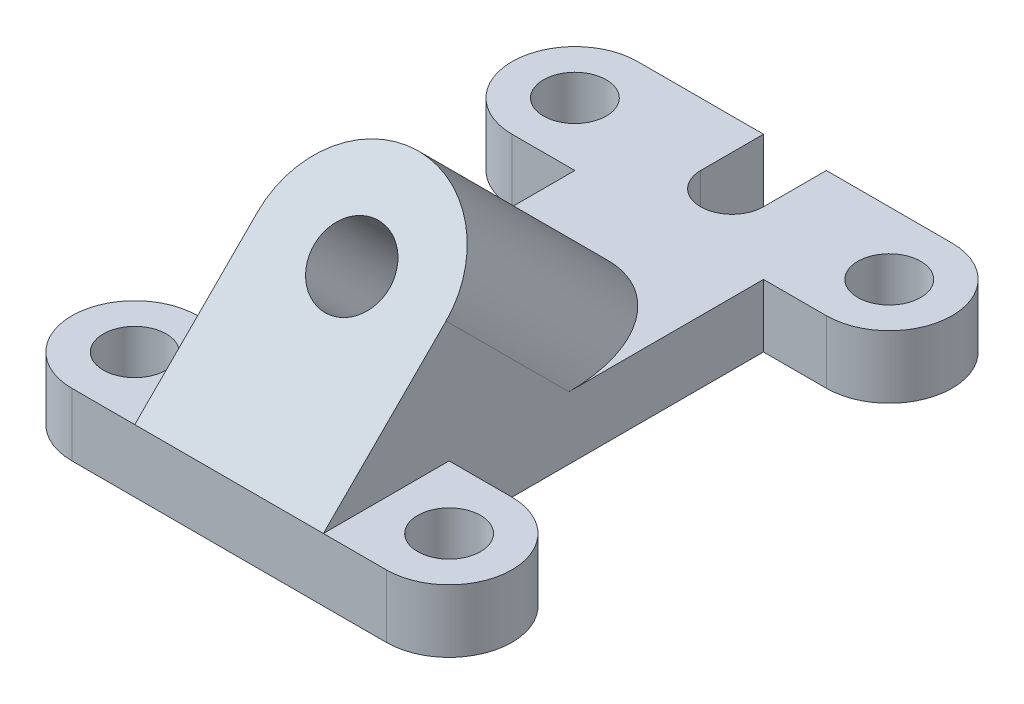
ISO-10303-21;
HEADER;
FILE_DESCRIPTION(('STEP AP214'),'2;1');
FILE_NAME('part.step','',(''),(''),'','','');
FILE_SCHEMA(('AUTOMOTIVE_DESIGN { 1 0 10303 214 1 1 1 1 }'));
ENDSEC;
DATA;
#1=APPLICATION_CONTEXT('core data for automotive mechanical design processes');
#2=APPLICATION_PROTOCOL_DEFINITION('international standard','automotive_design',2000,#1);
#3=PRODUCT_CONTEXT('',#1,'mechanical');
#4=PRODUCT('Part','Part','',(#3));
#5=PRODUCT_RELATED_PRODUCT_CATEGORY('part','',(#4));
#6=PRODUCT_DEFINITION_FORMATION('','',#4);
#7=PRODUCT_DEFINITION_CONTEXT('part definition',#1,'design');
#8=PRODUCT_DEFINITION('design','',#6,#7);
#9=PRODUCT_DEFINITION_SHAPE('','',#8);
#10=(LENGTH_UNIT() NAMED_UNIT(*) SI_UNIT(.MILLI.,.METRE.));
#11=(NAMED_UNIT(*) PLANE_ANGLE_UNIT() SI_UNIT($,.RADIAN.));
#12=(NAMED_UNIT(*) SI_UNIT($,.STERADIAN.) SOLID_ANGLE_UNIT());
#13=UNCERTAINTY_MEASURE_WITH_UNIT(LENGTH_MEASURE(1.E-05),#10,'distance_accuracy_value','');
#14=(GEOMETRIC_REPRESENTATION_CONTEXT(3) GLOBAL_UNCERTAINTY_ASSIGNED_CONTEXT((#13)) GLOBAL_UNIT_ASSIGNED_CONTEXT((#10,
#11,#12)) REPRESENTATION_CONTEXT('',''));
#15=CARTESIAN_POINT('',(0.,0.,0.));
#16=DIRECTION('',(0.,0.,1.));
#17=DIRECTION('',(1.,0.,0.));
#18=AXIS2_PLACEMENT_3D('',#15,#16,#17);
#19=CARTESIAN_POINT('',(-63.5,12.7,-88.9));
#20=DIRECTION('',(0.,1.,0.));
#21=DIRECTION('',(0.,0.,1.));
#22=AXIS2_PLACEMENT_3D('',#19,#20,#21);
#23=PLANE('',#22);
#24=CARTESIAN_POINT('',(0.,12.7,0.));
#25=DIRECTION('',(0.,1.,0.));
#26=DIRECTION('',(0.,0.,1.));
#27=AXIS2_PLACEMENT_3D('',#24,#25,#26);
#28=CIRCLE('',#27,6.35);
#29=CARTESIAN_POINT('',(0.,12.7,6.35));
#30=VERTEX_POINT('',#29);
#31=EDGE_CURVE('E213',#30,#30,#28,.T.);
#32=ORIENTED_EDGE('',*,*,#31,.F.);
#33=EDGE_LOOP('',(#32));
#34=FACE_BOUND('',#33,.T.);
#35=DIRECTION('',(-1.,0.,0.));
#36=VECTOR('',#35,1.);
#37=CARTESIAN_POINT('',(-12.7,12.7,-12.7));
#38=LINE('',#37,#36);
#39=CARTESIAN_POINT('',(0.,12.7,-12.7));
#40=VERTEX_POINT('',#39);
#41=CARTESIAN_POINT('',(-12.7,12.7,-12.7));
#42=VERTEX_POINT('',#41);
#43=EDGE_CURVE('E327',#40,#42,#38,.T.);
#44=ORIENTED_EDGE('',*,*,#43,.T.);
#45=DIRECTION('',(0.,0.,1.));
#46=VECTOR('',#45,1.);
#47=CARTESIAN_POINT('',(-12.7,12.7,-75.5869211077134));
#48=LINE('',#47,#46);
#49=CARTESIAN_POINT('',(-12.7,12.7,12.7));
#50=VERTEX_POINT('',#49);
#51=EDGE_CURVE('E12',#42,#50,#48,.T.);
#52=ORIENTED_EDGE('',*,*,#51,.T.);
#53=DIRECTION('',(1.,0.,0.));
#54=VECTOR('',#53,1.);
#55=CARTESIAN_POINT('',(-63.5,12.7,12.7));
#56=LINE('',#55,#54);
#57=CARTESIAN_POINT('',(0.,12.7,12.7));
#58=VERTEX_POINT('',#57);
#59=EDGE_CURVE('E321',#50,#58,#56,.T.);
#60=ORIENTED_EDGE('',*,*,#59,.T.);
#61=CARTESIAN_POINT('',(0.,12.7,0.));
#62=DIRECTION('',(0.,1.,0.));
#63=DIRECTION('',(0.,0.,1.));
#64=AXIS2_PLACEMENT_3D('',#61,#62,#63);
#65=CIRCLE('',#64,12.7);
#66=EDGE_CURVE('E325',#58,#40,#65,.T.);
#67=ORIENTED_EDGE('',*,*,#66,.T.);
#68=EDGE_LOOP('',(#44,#52,#60,#67));
#69=FACE_BOUND('',#68,.T.);
#70=ADVANCED_FACE('F54',(#34,#69),#23,.T.);
#71=CARTESIAN_POINT('',(-63.5,12.7,0.));
#72=DIRECTION('',(0.,1.,0.));
#73=DIRECTION('',(0.,0.,1.));
#74=AXIS2_PLACEMENT_3D('',#71,#72,#73);
#75=CIRCLE('',#74,6.35);
#76=CARTESIAN_POINT('',(-63.5,12.7,6.35));
#77=VERTEX_POINT('',#76);
#78=EDGE_CURVE('E297',#77,#77,#75,.T.);
#79=ORIENTED_EDGE('',*,*,#78,.F.);
#80=EDGE_LOOP('',(#79));
#81=FACE_BOUND('',#80,.T.);
#82=CARTESIAN_POINT('',(-63.5,12.7,12.7));
#83=VERTEX_POINT('',#82);
#84=CARTESIAN_POINT('',(-50.8,12.7,12.7));
#85=VERTEX_POINT('',#84);
#86=EDGE_CURVE('E322',#83,#85,#56,.T.);
#87=ORIENTED_EDGE('',*,*,#86,.T.);
#88=DIRECTION('',(0.,0.,-1.));
#89=VECTOR('',#88,1.);
#90=CARTESIAN_POINT('',(-50.8,12.7,-50.8014142135626));
#91=LINE('',#90,#89);
#92=CARTESIAN_POINT('',(-50.8,12.7,-12.7));
#93=VERTEX_POINT('',#92);
#94=EDGE_CURVE('E286',#85,#93,#91,.T.);
#95=ORIENTED_EDGE('',*,*,#94,.T.);
#96=DIRECTION('',(-1.,0.,0.));
#97=VECTOR('',#96,1.);
#98=CARTESIAN_POINT('',(-50.8,12.7,-12.7));
#99=LINE('',#98,#97);
#100=CARTESIAN_POINT('',(-63.5,12.7,-12.7));
#101=VERTEX_POINT('',#100);
#102=EDGE_CURVE('E317',#93,#101,#99,.T.);
#103=ORIENTED_EDGE('',*,*,#102,.T.);
#104=CARTESIAN_POINT('',(-63.5,12.7,0.));
#105=DIRECTION('',(0.,1.,0.));
#106=DIRECTION('',(0.,0.,1.));
#107=AXIS2_PLACEMENT_3D('',#104,#105,#106);
#108=CIRCLE('',#107,12.7);
#109=EDGE_CURVE('E319',#101,#83,#108,.T.);
#110=ORIENTED_EDGE('',*,*,#109,.T.);
#111=EDGE_LOOP('',(#87,#95,#103,#110));
#112=FACE_BOUND('',#111,.T.);
#113=ADVANCED_FACE('F429',(#81,#112),#23,.T.);
#114=DIRECTION('',(0.,0.,1.));
#115=VECTOR('',#114,1.);
#116=CARTESIAN_POINT('',(-50.8,12.7,-76.2));
#117=LINE('',#116,#115);
#118=CARTESIAN_POINT('',(-50.8,12.7,-76.2));
#119=VERTEX_POINT('',#118);
#120=CARTESIAN_POINT('',(-50.8,12.7,-36.8710137883018));
#121=VERTEX_POINT('',#120);
#122=EDGE_CURVE('E315',#119,#121,#117,.T.);
#123=ORIENTED_EDGE('',*,*,#122,.T.);
#124=CARTESIAN_POINT('',(-31.75,12.7,-36.8710137883018));
#125=DIRECTION('',(0.,1.,0.));
#126=DIRECTION('',(0.,0.,1.));
#127=AXIS2_PLACEMENT_3D('',#124,#125,#126);
#128=ELLIPSE('',#127,26.9407683632075,19.05);
#129=CARTESIAN_POINT('',(-12.7,12.7,-36.8710137883018));
#130=VERTEX_POINT('',#129);
#131=EDGE_CURVE('E288',#121,#130,#128,.F.);
#132=ORIENTED_EDGE('',*,*,#131,.T.);
#133=DIRECTION('',(0.,0.,-1.));
#134=VECTOR('',#133,1.);
#135=CARTESIAN_POINT('',(-12.7,12.7,-76.2));
#136=LINE('',#135,#134);
#137=CARTESIAN_POINT('',(-12.7,12.7,-76.2));
#138=VERTEX_POINT('',#137);
#139=EDGE_CURVE('E330',#130,#138,#136,.T.);
#140=ORIENTED_EDGE('',*,*,#139,.T.);
#141=DIRECTION('',(1.,0.,0.));
#142=VECTOR('',#141,1.);
#143=CARTESIAN_POINT('',(0.,12.7,-76.2));
#144=LINE('',#143,#142);
#145=CARTESIAN_POINT('',(0.,12.7,-76.2));
#146=VERTEX_POINT('',#145);
#147=EDGE_CURVE('E332',#138,#146,#144,.T.);
#148=ORIENTED_EDGE('',*,*,#147,.T.);
#149=CARTESIAN_POINT('',(0.,12.7,-88.9));
#150=DIRECTION('',(0.,1.,0.));
#151=DIRECTION('',(0.,0.,1.));
#152=AXIS2_PLACEMENT_3D('',#149,#150,#151);
#153=CIRCLE('',#152,12.7);
#154=CARTESIAN_POINT('',(0.,12.7,-101.6));
#155=VERTEX_POINT('',#154);
#156=EDGE_CURVE('E334',#146,#155,#153,.T.);
#157=ORIENTED_EDGE('',*,*,#156,.T.);
#158=DIRECTION('',(-1.,0.,0.));
#159=VECTOR('',#158,1.);
#160=CARTESIAN_POINT('',(-25.4,12.7,-101.6));
#161=LINE('',#160,#159);
#162=CARTESIAN_POINT('',(-25.4,12.7,-101.6));
#163=VERTEX_POINT('',#162);
#164=EDGE_CURVE('E336',#155,#163,#161,.T.);
#165=ORIENTED_EDGE('',*,*,#164,.T.);
#166=DIRECTION('',(0.,0.,1.));
#167=VECTOR('',#166,1.);
#168=CARTESIAN_POINT('',(-25.4,12.7,-88.9));
#169=LINE('',#168,#167);
#170=CARTESIAN_POINT('',(-25.4,12.7,-88.9));
#171=VERTEX_POINT('',#170);
#172=EDGE_CURVE('E188',#163,#171,#169,.T.);
#173=ORIENTED_EDGE('',*,*,#172,.T.);
#174=CARTESIAN_POINT('',(-31.75,12.7,-88.9));
#175=DIRECTION('',(0.,-1.,0.));
#176=DIRECTION('',(0.,0.,1.));
#177=AXIS2_PLACEMENT_3D('',#174,#175,#176);
#178=CIRCLE('',#177,6.35);
#179=CARTESIAN_POINT('',(-38.1,12.7,-88.9));
#180=VERTEX_POINT('',#179);
#181=EDGE_CURVE('E179',#171,#180,#178,.T.);
#182=ORIENTED_EDGE('',*,*,#181,.T.);
#183=DIRECTION('',(0.,0.,-1.));
#184=VECTOR('',#183,1.);
#185=CARTESIAN_POINT('',(-38.1,12.7,-101.6));
#186=LINE('',#185,#184);
#187=CARTESIAN_POINT('',(-38.1,12.7,-101.6));
#188=VERTEX_POINT('',#187);
#189=EDGE_CURVE('E185',#180,#188,#186,.T.);
#190=ORIENTED_EDGE('',*,*,#189,.T.);
#191=DIRECTION('',(-1.,0.,0.));
#192=VECTOR('',#191,1.);
#193=CARTESIAN_POINT('',(-63.5,12.7,-101.6));
#194=LINE('',#193,#192);
#195=CARTESIAN_POINT('',(-63.5,12.7,-101.6));
#196=VERTEX_POINT('',#195);
#197=EDGE_CURVE('E80',#188,#196,#194,.T.);
#198=ORIENTED_EDGE('',*,*,#197,.T.);
#199=CARTESIAN_POINT('',(-63.5,12.7,-88.9));
#200=DIRECTION('',(0.,1.,0.));
#201=DIRECTION('',(0.,0.,1.));
#202=AXIS2_PLACEMENT_3D('',#199,#200,#201);
#203=CIRCLE('',#202,12.7);
#204=CARTESIAN_POINT('',(-63.5,12.7,-76.2));
#205=VERTEX_POINT('',#204);
#206=EDGE_CURVE('E241',#196,#205,#203,.T.);
#207=ORIENTED_EDGE('',*,*,#206,.T.);
#208=DIRECTION('',(1.,0.,0.));
#209=VECTOR('',#208,1.);
#210=CARTESIAN_POINT('',(-63.5,12.7,-76.2));
#211=LINE('',#210,#209);
#212=EDGE_CURVE('E146',#205,#119,#211,.T.);
#213=ORIENTED_EDGE('',*,*,#212,.T.);
#214=EDGE_LOOP('',(#123,#132,#140,#148,#157,#165,#173,#182,#190,#198,#207,#213));
#215=FACE_BOUND('',#214,.T.);
#216=CARTESIAN_POINT('',(0.,12.7,-88.9));
#217=DIRECTION('',(0.,1.,0.));
#218=DIRECTION('',(0.,0.,1.));
#219=AXIS2_PLACEMENT_3D('',#216,#217,#218);
#220=CIRCLE('',#219,6.35);
#221=CARTESIAN_POINT('',(0.,12.7,-82.55));
#222=VERTEX_POINT('',#221);
#223=EDGE_CURVE('E303',#222,#222,#220,.T.);
#224=ORIENTED_EDGE('',*,*,#223,.F.);
#225=EDGE_LOOP('',(#224));
#226=FACE_BOUND('',#225,.T.);
#227=CARTESIAN_POINT('',(-63.5,12.7,-88.9));
#228=DIRECTION('',(0.,1.,0.));
#229=DIRECTION('',(0.,0.,1.));
#230=AXIS2_PLACEMENT_3D('',#227,#228,#229);
#231=CIRCLE('',#230,6.35000000000001);
#232=CARTESIAN_POINT('',(-63.5,12.7,-82.55));
#233=VERTEX_POINT('',#232);
#234=EDGE_CURVE('E290',#233,#233,#231,.T.);
#235=ORIENTED_EDGE('',*,*,#234,.F.);
#236=EDGE_LOOP('',(#235));
#237=FACE_BOUND('',#236,.T.);
#238=ADVANCED_FACE('F182',(#215,#226,#237),#23,.T.);
#239=CARTESIAN_POINT('',(-63.5,0.,-88.9));
#240=DIRECTION('',(0.,1.,0.));
#241=DIRECTION('',(0.,0.,1.));
#242=AXIS2_PLACEMENT_3D('',#239,#240,#241);
#243=PLANE('',#242);
#244=CARTESIAN_POINT('',(-63.5,0.,-88.9));
#245=DIRECTION('',(0.,1.,0.));
#246=DIRECTION('',(0.,0.,1.));
#247=AXIS2_PLACEMENT_3D('',#244,#245,#246);
#248=CIRCLE('',#247,12.7);
#249=CARTESIAN_POINT('',(-63.5,0.,-101.6));
#250=VERTEX_POINT('',#249);
#251=CARTESIAN_POINT('',(-63.5,0.,-76.2));
#252=VERTEX_POINT('',#251);
#253=EDGE_CURVE('E209',#250,#252,#248,.T.);
#254=ORIENTED_EDGE('',*,*,#253,.F.);
#255=DIRECTION('',(-1.,0.,0.));
#256=VECTOR('',#255,1.);
#257=CARTESIAN_POINT('',(-63.5,0.,-101.6));
#258=LINE('',#257,#256);
#259=CARTESIAN_POINT('',(-38.1,0.,-101.6));
#260=VERTEX_POINT('',#259);
#261=EDGE_CURVE('E137',#260,#250,#258,.T.);
#262=ORIENTED_EDGE('',*,*,#261,.F.);
#263=DIRECTION('',(0.,0.,-1.));
#264=VECTOR('',#263,1.);
#265=CARTESIAN_POINT('',(-38.1,0.,-101.6));
#266=LINE('',#265,#264);
#267=CARTESIAN_POINT('',(-38.1,0.,-88.9));
#268=VERTEX_POINT('',#267);
#269=EDGE_CURVE('E238',#268,#260,#266,.T.);
#270=ORIENTED_EDGE('',*,*,#269,.F.);
#271=CARTESIAN_POINT('',(-31.75,0.,-88.9));
#272=DIRECTION('',(0.,-1.,0.));
#273=DIRECTION('',(0.,0.,1.));
#274=AXIS2_PLACEMENT_3D('',#271,#272,#273);
#275=CIRCLE('',#274,6.35);
#276=CARTESIAN_POINT('',(-25.4,0.,-88.9));
#277=VERTEX_POINT('',#276);
#278=EDGE_CURVE('E197',#277,#268,#275,.T.);
#279=ORIENTED_EDGE('',*,*,#278,.F.);
#280=DIRECTION('',(0.,0.,1.));
#281=VECTOR('',#280,1.);
#282=CARTESIAN_POINT('',(-25.4,0.,-88.9));
#283=LINE('',#282,#281);
#284=CARTESIAN_POINT('',(-25.4,0.,-101.6));
#285=VERTEX_POINT('',#284);
#286=EDGE_CURVE('E235',#285,#277,#283,.T.);
#287=ORIENTED_EDGE('',*,*,#286,.F.);
#288=DIRECTION('',(-1.,0.,0.));
#289=VECTOR('',#288,1.);
#290=CARTESIAN_POINT('',(-25.4,0.,-101.6));
#291=LINE('',#290,#289);
#292=CARTESIAN_POINT('',(0.,0.,-101.6));
#293=VERTEX_POINT('',#292);
#294=EDGE_CURVE('E233',#293,#285,#291,.T.);
#295=ORIENTED_EDGE('',*,*,#294,.F.);
#296=CARTESIAN_POINT('',(0.,0.,-88.9));
#297=DIRECTION('',(0.,1.,0.));
#298=DIRECTION('',(0.,0.,1.));
#299=AXIS2_PLACEMENT_3D('',#296,#297,#298);
#300=CIRCLE('',#299,12.7);
#301=CARTESIAN_POINT('',(0.,0.,-76.2));
#302=VERTEX_POINT('',#301);
#303=EDGE_CURVE('E231',#302,#293,#300,.T.);
#304=ORIENTED_EDGE('',*,*,#303,.F.);
#305=DIRECTION('',(1.,0.,0.));
#306=VECTOR('',#305,1.);
#307=CARTESIAN_POINT('',(0.,0.,-76.2));
#308=LINE('',#307,#306);
#309=CARTESIAN_POINT('',(-12.7,0.,-76.2));
#310=VERTEX_POINT('',#309);
#311=EDGE_CURVE('E229',#310,#302,#308,.T.);
#312=ORIENTED_EDGE('',*,*,#311,.F.);
#313=DIRECTION('',(0.,0.,-1.));
#314=VECTOR('',#313,1.);
#315=CARTESIAN_POINT('',(-12.7,0.,-76.2));
#316=LINE('',#315,#314);
#317=CARTESIAN_POINT('',(-12.7,0.,-12.7));
#318=VERTEX_POINT('',#317);
#319=EDGE_CURVE('E227',#318,#310,#316,.T.);
#320=ORIENTED_EDGE('',*,*,#319,.F.);
#321=DIRECTION('',(-1.,0.,0.));
#322=VECTOR('',#321,1.);
#323=CARTESIAN_POINT('',(-12.7,0.,-12.7));
#324=LINE('',#323,#322);
#325=CARTESIAN_POINT('',(0.,0.,-12.7));
#326=VERTEX_POINT('',#325);
#327=EDGE_CURVE('E225',#326,#318,#324,.T.);
#328=ORIENTED_EDGE('',*,*,#327,.F.);
#329=CARTESIAN_POINT('',(0.,0.,0.));
#330=DIRECTION('',(0.,1.,0.));
#331=DIRECTION('',(0.,0.,1.));
#332=AXIS2_PLACEMENT_3D('',#329,#330,#331);
#333=CIRCLE('',#332,12.7);
#334=CARTESIAN_POINT('',(0.,0.,12.7));
#335=VERTEX_POINT('',#334);
#336=EDGE_CURVE('E223',#335,#326,#333,.T.);
#337=ORIENTED_EDGE('',*,*,#336,.F.);
#338=DIRECTION('',(1.,0.,0.));
#339=VECTOR('',#338,1.);
#340=CARTESIAN_POINT('',(-63.5,0.,12.7));
#341=LINE('',#340,#339);
#342=CARTESIAN_POINT('',(-63.5,0.,12.7));
#343=VERTEX_POINT('',#342);
#344=EDGE_CURVE('E221',#343,#335,#341,.T.);
#345=ORIENTED_EDGE('',*,*,#344,.F.);
#346=CARTESIAN_POINT('',(-63.5,0.,0.));
#347=DIRECTION('',(0.,1.,0.));
#348=DIRECTION('',(0.,0.,1.));
#349=AXIS2_PLACEMENT_3D('',#346,#347,#348);
#350=CIRCLE('',#349,12.7);
#351=CARTESIAN_POINT('',(-63.5,0.,-12.7));
#352=VERTEX_POINT('',#351);
#353=EDGE_CURVE('E219',#352,#343,#350,.T.);
#354=ORIENTED_EDGE('',*,*,#353,.F.);
#355=DIRECTION('',(-1.,0.,0.));
#356=VECTOR('',#355,1.);
#357=CARTESIAN_POINT('',(-50.8,0.,-12.7));
#358=LINE('',#357,#356);
#359=CARTESIAN_POINT('',(-50.8,0.,-12.7));
#360=VERTEX_POINT('',#359);
#361=EDGE_CURVE('E217',#360,#352,#358,.T.);
#362=ORIENTED_EDGE('',*,*,#361,.F.);
#363=DIRECTION('',(0.,0.,1.));
#364=VECTOR('',#363,1.);
#365=CARTESIAN_POINT('',(-50.8,0.,-76.2));
#366=LINE('',#365,#364);
#367=CARTESIAN_POINT('',(-50.8,0.,-76.2));
#368=VERTEX_POINT('',#367);
#369=EDGE_CURVE('E215',#368,#360,#366,.T.);
#370=ORIENTED_EDGE('',*,*,#369,.F.);
#371=DIRECTION('',(1.,0.,0.));
#372=VECTOR('',#371,1.);
#373=CARTESIAN_POINT('',(-63.5,0.,-76.2));
#374=LINE('',#373,#372);
#375=EDGE_CURVE('E212',#252,#368,#374,.T.);
#376=ORIENTED_EDGE('',*,*,#375,.F.);
#377=EDGE_LOOP('',(#254,#262,#270,#279,#287,#295,#304,#312,#320,#328,#337,#345,#354,#362,#370,#376));
#378=FACE_BOUND('',#377,.T.);
#379=CARTESIAN_POINT('',(0.,0.,0.));
#380=DIRECTION('',(0.,1.,0.));
#381=DIRECTION('',(0.,0.,1.));
#382=AXIS2_PLACEMENT_3D('',#379,#380,#381);
#383=CIRCLE('',#382,6.35);
#384=CARTESIAN_POINT('',(0.,0.,6.35));
#385=VERTEX_POINT('',#384);
#386=EDGE_CURVE('E306',#385,#385,#383,.T.);
#387=ORIENTED_EDGE('',*,*,#386,.T.);
#388=EDGE_LOOP('',(#387));
#389=FACE_BOUND('',#388,.T.);
#390=CARTESIAN_POINT('',(0.,0.,-88.9));
#391=DIRECTION('',(0.,1.,0.));
#392=DIRECTION('',(0.,0.,1.));
#393=AXIS2_PLACEMENT_3D('',#390,#391,#392);
#394=CIRCLE('',#393,6.35);
#395=CARTESIAN_POINT('',(0.,0.,-82.55));
#396=VERTEX_POINT('',#395);
#397=EDGE_CURVE('E300',#396,#396,#394,.T.);
#398=ORIENTED_EDGE('',*,*,#397,.T.);
#399=EDGE_LOOP('',(#398));
#400=FACE_BOUND('',#399,.T.);
#401=CARTESIAN_POINT('',(-63.5,0.,0.));
#402=DIRECTION('',(0.,1.,0.));
#403=DIRECTION('',(0.,0.,1.));
#404=AXIS2_PLACEMENT_3D('',#401,#402,#403);
#405=CIRCLE('',#404,6.35);
#406=CARTESIAN_POINT('',(-63.5,0.,6.35));
#407=VERTEX_POINT('',#406);
#408=EDGE_CURVE('E293',#407,#407,#405,.T.);
#409=ORIENTED_EDGE('',*,*,#408,.T.);
#410=EDGE_LOOP('',(#409));
#411=FACE_BOUND('',#410,.T.);
#412=CARTESIAN_POINT('',(-63.5,0.,-88.9));
#413=DIRECTION('',(0.,1.,0.));
#414=DIRECTION('',(0.,0.,1.));
#415=AXIS2_PLACEMENT_3D('',#412,#413,#414);
#416=CIRCLE('',#415,6.35000000000001);
#417=CARTESIAN_POINT('',(-63.5,0.,-82.55));
#418=VERTEX_POINT('',#417);
#419=EDGE_CURVE('E294',#418,#418,#416,.T.);
#420=ORIENTED_EDGE('',*,*,#419,.T.);
#421=EDGE_LOOP('',(#420));
#422=FACE_BOUND('',#421,.T.);
#423=ADVANCED_FACE('F349',(#378,#389,#400,#411,#422),#243,.F.);
#424=CARTESIAN_POINT('',(-63.5,12.7,-88.9));
#425=DIRECTION('',(0.,-1.,0.));
#426=DIRECTION('',(0.,0.,-1.));
#427=AXIS2_PLACEMENT_3D('',#424,#425,#426);
#428=CYLINDRICAL_SURFACE('',#427,12.7);
#429=ORIENTED_EDGE('',*,*,#253,.T.);
#430=DIRECTION('',(0.,-1.,0.));
#431=VECTOR('',#430,1.);
#432=CARTESIAN_POINT('',(-63.5,12.7,-76.2));
#433=LINE('',#432,#431);
#434=EDGE_CURVE('E58',#205,#252,#433,.T.);
#435=ORIENTED_EDGE('',*,*,#434,.F.);
#436=ORIENTED_EDGE('',*,*,#206,.F.);
#437=DIRECTION('',(0.,-1.,0.));
#438=VECTOR('',#437,1.);
#439=CARTESIAN_POINT('',(-63.5,12.7,-101.6));
#440=LINE('',#439,#438);
#441=EDGE_CURVE('E205',#196,#250,#440,.T.);
#442=ORIENTED_EDGE('',*,*,#441,.T.);
#443=EDGE_LOOP('',(#429,#435,#436,#442));
#444=FACE_BOUND('',#443,.T.);
#445=ADVANCED_FACE('F56',(#444),#428,.T.);
#446=CARTESIAN_POINT('',(-63.5,12.7,-76.2));
#447=DIRECTION('',(0.,0.,-1.));
#448=DIRECTION('',(-1.,0.,0.));
#449=AXIS2_PLACEMENT_3D('',#446,#447,#448);
#450=PLANE('',#449);
#451=ORIENTED_EDGE('',*,*,#375,.T.);
#452=DIRECTION('',(0.,-1.,0.));
#453=VECTOR('',#452,1.);
#454=CARTESIAN_POINT('',(-50.8,12.7,-76.2));
#455=LINE('',#454,#453);
#456=EDGE_CURVE('E274',#119,#368,#455,.T.);
#457=ORIENTED_EDGE('',*,*,#456,.F.);
#458=ORIENTED_EDGE('',*,*,#212,.F.);
#459=ORIENTED_EDGE('',*,*,#434,.T.);
#460=EDGE_LOOP('',(#451,#457,#458,#459));
#461=FACE_BOUND('',#460,.T.);
#462=ADVANCED_FACE('F355',(#461),#450,.F.);
#463=CARTESIAN_POINT('',(-50.8,12.7,-76.2));
#464=DIRECTION('',(1.,0.,0.));
#465=DIRECTION('',(0.,0.,-1.));
#466=AXIS2_PLACEMENT_3D('',#463,#464,#465);
#467=PLANE('',#466);
#468=ORIENTED_EDGE('',*,*,#369,.T.);
#469=DIRECTION('',(0.,-1.,0.));
#470=VECTOR('',#469,1.);
#471=CARTESIAN_POINT('',(-50.8,12.7,-12.7));
#472=LINE('',#471,#470);
#473=EDGE_CURVE('E272',#93,#360,#472,.T.);
#474=ORIENTED_EDGE('',*,*,#473,.F.);
#475=ORIENTED_EDGE('',*,*,#94,.F.);
#476=DIRECTION('',(0.,-0.707106781186549,0.707106781186546));
#477=VECTOR('',#476,1.);
#478=CARTESIAN_POINT('',(-50.8,12.7,12.7));
#479=LINE('',#478,#477);
#480=CARTESIAN_POINT('',(-50.8,37.4855068941509,-12.0855068941508));
#481=VERTEX_POINT('',#480);
#482=EDGE_CURVE('E364',#481,#85,#479,.T.);
#483=ORIENTED_EDGE('',*,*,#482,.F.);
#484=DIRECTION('',(0.,0.707106781186546,0.707106781186549));
#485=VECTOR('',#484,1.);
#486=CARTESIAN_POINT('',(-50.8,-26.0159073194114,-75.5869211077134));
#487=LINE('',#486,#485);
#488=EDGE_CURVE('E360',#121,#481,#487,.T.);
#489=ORIENTED_EDGE('',*,*,#488,.F.);
#490=ORIENTED_EDGE('',*,*,#122,.F.);
#491=ORIENTED_EDGE('',*,*,#456,.T.);
#492=EDGE_LOOP('',(#468,#474,#475,#483,#489,#490,#491));
#493=FACE_BOUND('',#492,.T.);
#494=ADVANCED_FACE('F357',(#493),#467,.F.);
#495=CARTESIAN_POINT('',(-50.8,12.7,-12.7));
#496=DIRECTION('',(0.,0.,1.));
#497=DIRECTION('',(1.,0.,0.));
#498=AXIS2_PLACEMENT_3D('',#495,#496,#497);
#499=PLANE('',#498);
#500=ORIENTED_EDGE('',*,*,#361,.T.);
#501=DIRECTION('',(0.,-1.,0.));
#502=VECTOR('',#501,1.);
#503=CARTESIAN_POINT('',(-63.5,12.7,-12.7));
#504=LINE('',#503,#502);
#505=EDGE_CURVE('E269',#101,#352,#504,.T.);
#506=ORIENTED_EDGE('',*,*,#505,.F.);
#507=ORIENTED_EDGE('',*,*,#102,.F.);
#508=ORIENTED_EDGE('',*,*,#473,.T.);
#509=EDGE_LOOP('',(#500,#506,#507,#508));
#510=FACE_BOUND('',#509,.T.);
#511=ADVANCED_FACE('F562',(#510),#499,.F.);
#512=CARTESIAN_POINT('',(-63.5,12.7,0.));
#513=DIRECTION('',(0.,-1.,0.));
#514=DIRECTION('',(0.,0.,-1.));
#515=AXIS2_PLACEMENT_3D('',#512,#513,#514);
#516=CYLINDRICAL_SURFACE('',#515,12.7);
#517=ORIENTED_EDGE('',*,*,#353,.T.);
#518=DIRECTION('',(0.,-1.,0.));
#519=VECTOR('',#518,1.);
#520=CARTESIAN_POINT('',(-63.5,12.7,12.7));
#521=LINE('',#520,#519);
#522=EDGE_CURVE('E266',#83,#343,#521,.T.);
#523=ORIENTED_EDGE('',*,*,#522,.F.);
#524=ORIENTED_EDGE('',*,*,#109,.F.);
#525=ORIENTED_EDGE('',*,*,#505,.T.);
#526=EDGE_LOOP('',(#517,#523,#524,#525));
#527=FACE_BOUND('',#526,.T.);
#528=ADVANCED_FACE('F606',(#527),#516,.T.);
#529=CARTESIAN_POINT('',(-63.5,12.7,12.7));
#530=DIRECTION('',(0.,0.,-1.));
#531=DIRECTION('',(-1.,0.,0.));
#532=AXIS2_PLACEMENT_3D('',#529,#530,#531);
#533=PLANE('',#532);
#534=ORIENTED_EDGE('',*,*,#344,.T.);
#535=DIRECTION('',(0.,-1.,0.));
#536=VECTOR('',#535,1.);
#537=CARTESIAN_POINT('',(0.,12.7,12.7));
#538=LINE('',#537,#536);
#539=EDGE_CURVE('E263',#58,#335,#538,.T.);
#540=ORIENTED_EDGE('',*,*,#539,.F.);
#541=ORIENTED_EDGE('',*,*,#59,.F.);
#542=DIRECTION('',(1.,0.,0.));
#543=VECTOR('',#542,1.);
#544=CARTESIAN_POINT('',(-50.8,12.7,12.7));
#545=LINE('',#544,#543);
#546=EDGE_CURVE('E379',#85,#50,#545,.T.);
#547=ORIENTED_EDGE('',*,*,#546,.F.);
#548=ORIENTED_EDGE('',*,*,#86,.F.);
#549=ORIENTED_EDGE('',*,*,#522,.T.);
#550=EDGE_LOOP('',(#534,#540,#541,#547,#548,#549));
#551=FACE_BOUND('',#550,.T.);
#552=ADVANCED_FACE('F400',(#551),#533,.F.);
#553=CARTESIAN_POINT('',(0.,12.7,0.));
#554=DIRECTION('',(0.,-1.,0.));
#555=DIRECTION('',(0.,0.,-1.));
#556=AXIS2_PLACEMENT_3D('',#553,#554,#555);
#557=CYLINDRICAL_SURFACE('',#556,12.7);
#558=ORIENTED_EDGE('',*,*,#336,.T.);
#559=DIRECTION('',(0.,-1.,0.));
#560=VECTOR('',#559,1.);
#561=CARTESIAN_POINT('',(0.,12.7,-12.7));
#562=LINE('',#561,#560);
#563=EDGE_CURVE('E260',#40,#326,#562,.T.);
#564=ORIENTED_EDGE('',*,*,#563,.F.);
#565=ORIENTED_EDGE('',*,*,#66,.F.);
#566=ORIENTED_EDGE('',*,*,#539,.T.);
#567=EDGE_LOOP('',(#558,#564,#565,#566));
#568=FACE_BOUND('',#567,.T.);
#569=ADVANCED_FACE('F406',(#568),#557,.T.);
#570=CARTESIAN_POINT('',(-12.7,12.7,-12.7));
#571=DIRECTION('',(0.,0.,1.));
#572=DIRECTION('',(1.,0.,0.));
#573=AXIS2_PLACEMENT_3D('',#570,#571,#572);
#574=PLANE('',#573);
#575=ORIENTED_EDGE('',*,*,#327,.T.);
#576=DIRECTION('',(0.,-1.,0.));
#577=VECTOR('',#576,1.);
#578=CARTESIAN_POINT('',(-12.7,12.7,-12.7));
#579=LINE('',#578,#577);
#580=EDGE_CURVE('E257',#42,#318,#579,.T.);
#581=ORIENTED_EDGE('',*,*,#580,.F.);
#582=ORIENTED_EDGE('',*,*,#43,.F.);
#583=ORIENTED_EDGE('',*,*,#563,.T.);
#584=EDGE_LOOP('',(#575,#581,#582,#583));
#585=FACE_BOUND('',#584,.T.);
#586=ADVANCED_FACE('F409',(#585),#574,.F.);
#587=CARTESIAN_POINT('',(-12.7,12.7,-76.2));
#588=DIRECTION('',(-1.,0.,0.));
#589=DIRECTION('',(0.,0.,1.));
#590=AXIS2_PLACEMENT_3D('',#587,#588,#589);
#591=PLANE('',#590);
#592=ORIENTED_EDGE('',*,*,#319,.T.);
#593=DIRECTION('',(0.,-1.,0.));
#594=VECTOR('',#593,1.);
#595=CARTESIAN_POINT('',(-12.7,12.7,-76.2));
#596=LINE('',#595,#594);
#597=EDGE_CURVE('E254',#138,#310,#596,.T.);
#598=ORIENTED_EDGE('',*,*,#597,.F.);
#599=ORIENTED_EDGE('',*,*,#139,.F.);
#600=DIRECTION('',(0.,0.707106781186546,0.707106781186549));
#601=VECTOR('',#600,1.);
#602=CARTESIAN_POINT('',(-12.7,-26.0159073194114,-75.5869211077134));
#603=LINE('',#602,#601);
#604=CARTESIAN_POINT('',(-12.7,37.4855068941509,-12.0855068941508));
#605=VERTEX_POINT('',#604);
#606=EDGE_CURVE('E71',#130,#605,#603,.T.);
#607=ORIENTED_EDGE('',*,*,#606,.T.);
#608=DIRECTION('',(0.,0.707106781186549,-0.707106781186546));
#609=VECTOR('',#608,1.);
#610=CARTESIAN_POINT('',(-12.7,37.4855068941509,-12.0855068941508));
#611=LINE('',#610,#609);
#612=EDGE_CURVE('E376',#50,#605,#611,.T.);
#613=ORIENTED_EDGE('',*,*,#612,.F.);
#614=ORIENTED_EDGE('',*,*,#51,.F.);
#615=ORIENTED_EDGE('',*,*,#580,.T.);
#616=EDGE_LOOP('',(#592,#598,#599,#607,#613,#614,#615));
#617=FACE_BOUND('',#616,.T.);
#618=ADVANCED_FACE('F394',(#617),#591,.F.);
#619=CARTESIAN_POINT('',(0.,12.7,-76.2));
#620=DIRECTION('',(0.,0.,-1.));
#621=DIRECTION('',(-1.,0.,0.));
#622=AXIS2_PLACEMENT_3D('',#619,#620,#621);
#623=PLANE('',#622);
#624=ORIENTED_EDGE('',*,*,#311,.T.);
#625=DIRECTION('',(0.,-1.,0.));
#626=VECTOR('',#625,1.);
#627=CARTESIAN_POINT('',(0.,12.7,-76.2));
#628=LINE('',#627,#626);
#629=EDGE_CURVE('E251',#146,#302,#628,.T.);
#630=ORIENTED_EDGE('',*,*,#629,.F.);
#631=ORIENTED_EDGE('',*,*,#147,.F.);
#632=ORIENTED_EDGE('',*,*,#597,.T.);
#633=EDGE_LOOP('',(#624,#630,#631,#632));
#634=FACE_BOUND('',#633,.T.);
#635=ADVANCED_FACE('F416',(#634),#623,.F.);
#636=CARTESIAN_POINT('',(0.,12.7,-88.9));
#637=DIRECTION('',(0.,-1.,0.));
#638=DIRECTION('',(0.,0.,-1.));
#639=AXIS2_PLACEMENT_3D('',#636,#637,#638);
#640=CYLINDRICAL_SURFACE('',#639,12.7);
#641=ORIENTED_EDGE('',*,*,#303,.T.);
#642=DIRECTION('',(0.,-1.,0.));
#643=VECTOR('',#642,1.);
#644=CARTESIAN_POINT('',(0.,12.7,-101.6));
#645=LINE('',#644,#643);
#646=EDGE_CURVE('E248',#155,#293,#645,.T.);
#647=ORIENTED_EDGE('',*,*,#646,.F.);
#648=ORIENTED_EDGE('',*,*,#156,.F.);
#649=ORIENTED_EDGE('',*,*,#629,.T.);
#650=EDGE_LOOP('',(#641,#647,#648,#649));
#651=FACE_BOUND('',#650,.T.);
#652=ADVANCED_FACE('F419',(#651),#640,.T.);
#653=CARTESIAN_POINT('',(-25.4,12.7,-101.6));
#654=DIRECTION('',(0.,0.,1.));
#655=DIRECTION('',(1.,0.,0.));
#656=AXIS2_PLACEMENT_3D('',#653,#654,#655);
#657=PLANE('',#656);
#658=ORIENTED_EDGE('',*,*,#294,.T.);
#659=DIRECTION('',(0.,-1.,0.));
#660=VECTOR('',#659,1.);
#661=CARTESIAN_POINT('',(-25.4,12.7,-101.6));
#662=LINE('',#661,#660);
#663=EDGE_CURVE('E245',#163,#285,#662,.T.);
#664=ORIENTED_EDGE('',*,*,#663,.F.);
#665=ORIENTED_EDGE('',*,*,#164,.F.);
#666=ORIENTED_EDGE('',*,*,#646,.T.);
#667=EDGE_LOOP('',(#658,#664,#665,#666));
#668=FACE_BOUND('',#667,.T.);
#669=ADVANCED_FACE('F342',(#668),#657,.F.);
#670=CARTESIAN_POINT('',(-25.4,12.7,-88.9));
#671=DIRECTION('',(1.,0.,0.));
#672=DIRECTION('',(0.,0.,-1.));
#673=AXIS2_PLACEMENT_3D('',#670,#671,#672);
#674=PLANE('',#673);
#675=ORIENTED_EDGE('',*,*,#286,.T.);
#676=DIRECTION('',(0.,-1.,0.));
#677=VECTOR('',#676,1.);
#678=CARTESIAN_POINT('',(-25.4,12.7,-88.9));
#679=LINE('',#678,#677);
#680=EDGE_CURVE('E200',#171,#277,#679,.T.);
#681=ORIENTED_EDGE('',*,*,#680,.F.);
#682=ORIENTED_EDGE('',*,*,#172,.F.);
#683=ORIENTED_EDGE('',*,*,#663,.T.);
#684=EDGE_LOOP('',(#675,#681,#682,#683));
#685=FACE_BOUND('',#684,.T.);
#686=ADVANCED_FACE('F346',(#685),#674,.F.);
#687=CARTESIAN_POINT('',(-31.75,12.7,-88.9));
#688=DIRECTION('',(0.,-1.,0.));
#689=DIRECTION('',(0.,0.,-1.));
#690=AXIS2_PLACEMENT_3D('',#687,#688,#689);
#691=CYLINDRICAL_SURFACE('',#690,6.35);
#692=ORIENTED_EDGE('',*,*,#278,.T.);
#693=DIRECTION('',(0.,-1.,0.));
#694=VECTOR('',#693,1.);
#695=CARTESIAN_POINT('',(-38.1,12.7,-88.9));
#696=LINE('',#695,#694);
#697=EDGE_CURVE('E194',#180,#268,#696,.T.);
#698=ORIENTED_EDGE('',*,*,#697,.F.);
#699=ORIENTED_EDGE('',*,*,#181,.F.);
#700=ORIENTED_EDGE('',*,*,#680,.T.);
#701=EDGE_LOOP('',(#692,#698,#699,#700));
#702=FACE_BOUND('',#701,.T.);
#703=ADVANCED_FACE('F195',(#702),#691,.F.);
#704=CARTESIAN_POINT('',(-38.1,12.7,-101.6));
#705=DIRECTION('',(-1.,0.,0.));
#706=DIRECTION('',(0.,0.,1.));
#707=AXIS2_PLACEMENT_3D('',#704,#705,#706);
#708=PLANE('',#707);
#709=ORIENTED_EDGE('',*,*,#269,.T.);
#710=DIRECTION('',(0.,-1.,0.));
#711=VECTOR('',#710,1.);
#712=CARTESIAN_POINT('',(-38.1,12.7,-101.6));
#713=LINE('',#712,#711);
#714=EDGE_CURVE('E201',#188,#260,#713,.T.);
#715=ORIENTED_EDGE('',*,*,#714,.F.);
#716=ORIENTED_EDGE('',*,*,#189,.F.);
#717=ORIENTED_EDGE('',*,*,#697,.T.);
#718=EDGE_LOOP('',(#709,#715,#716,#717));
#719=FACE_BOUND('',#718,.T.);
#720=ADVANCED_FACE('F203',(#719),#708,.F.);
#721=CARTESIAN_POINT('',(-63.5,12.7,-101.6));
#722=DIRECTION('',(0.,0.,1.));
#723=DIRECTION('',(1.,0.,0.));
#724=AXIS2_PLACEMENT_3D('',#721,#722,#723);
#725=PLANE('',#724);
#726=ORIENTED_EDGE('',*,*,#261,.T.);
#727=ORIENTED_EDGE('',*,*,#441,.F.);
#728=ORIENTED_EDGE('',*,*,#197,.F.);
#729=ORIENTED_EDGE('',*,*,#714,.T.);
#730=EDGE_LOOP('',(#726,#727,#728,#729));
#731=FACE_BOUND('',#730,.T.);
#732=ADVANCED_FACE('F351',(#731),#725,.F.);
#733=CARTESIAN_POINT('',(0.,12.7,0.));
#734=DIRECTION('',(0.,-1.,0.));
#735=DIRECTION('',(0.,0.,-1.));
#736=AXIS2_PLACEMENT_3D('',#733,#734,#735);
#737=CYLINDRICAL_SURFACE('',#736,6.35);
#738=ORIENTED_EDGE('',*,*,#31,.T.);
#739=EDGE_LOOP('',(#738));
#740=FACE_BOUND('',#739,.T.);
#741=ORIENTED_EDGE('',*,*,#386,.F.);
#742=EDGE_LOOP('',(#741));
#743=FACE_BOUND('',#742,.T.);
#744=ADVANCED_FACE('F472',(#740,#743),#737,.F.);
#745=CARTESIAN_POINT('',(0.,12.7,-88.9));
#746=DIRECTION('',(0.,-1.,0.));
#747=DIRECTION('',(0.,0.,-1.));
#748=AXIS2_PLACEMENT_3D('',#745,#746,#747);
#749=CYLINDRICAL_SURFACE('',#748,6.35);
#750=ORIENTED_EDGE('',*,*,#223,.T.);
#751=EDGE_LOOP('',(#750));
#752=FACE_BOUND('',#751,.T.);
#753=ORIENTED_EDGE('',*,*,#397,.F.);
#754=EDGE_LOOP('',(#753));
#755=FACE_BOUND('',#754,.T.);
#756=ADVANCED_FACE('F469',(#752,#755),#749,.F.);
#757=CARTESIAN_POINT('',(-63.5,12.7,0.));
#758=DIRECTION('',(0.,-1.,0.));
#759=DIRECTION('',(0.,0.,-1.));
#760=AXIS2_PLACEMENT_3D('',#757,#758,#759);
#761=CYLINDRICAL_SURFACE('',#760,6.35);
#762=ORIENTED_EDGE('',*,*,#78,.T.);
#763=EDGE_LOOP('',(#762));
#764=FACE_BOUND('',#763,.T.);
#765=ORIENTED_EDGE('',*,*,#408,.F.);
#766=EDGE_LOOP('',(#765));
#767=FACE_BOUND('',#766,.T.);
#768=ADVANCED_FACE('F463',(#764,#767),#761,.F.);
#769=CARTESIAN_POINT('',(-63.5,12.7,-88.9));
#770=DIRECTION('',(0.,-1.,0.));
#771=DIRECTION('',(0.,0.,-1.));
#772=AXIS2_PLACEMENT_3D('',#769,#770,#771);
#773=CYLINDRICAL_SURFACE('',#772,6.35000000000001);
#774=ORIENTED_EDGE('',*,*,#234,.T.);
#775=EDGE_LOOP('',(#774));
#776=FACE_BOUND('',#775,.T.);
#777=ORIENTED_EDGE('',*,*,#419,.F.);
#778=EDGE_LOOP('',(#777));
#779=FACE_BOUND('',#778,.T.);
#780=ADVANCED_FACE('F455',(#776,#779),#773,.F.);
#781=CARTESIAN_POINT('',(-31.75,-26.0159073194114,-75.5869211077134));
#782=DIRECTION('',(0.,0.707106781186546,0.707106781186549));
#783=DIRECTION('',(0.,-0.707106781186549,0.707106781186546));
#784=AXIS2_PLACEMENT_3D('',#781,#782,#783);
#785=CYLINDRICAL_SURFACE('',#784,19.05);
#786=ORIENTED_EDGE('',*,*,#131,.F.);
#787=ORIENTED_EDGE('',*,*,#488,.T.);
#788=CARTESIAN_POINT('',(-31.75,37.4855068941509,-12.0855068941508));
#789=DIRECTION('',(0.,0.707106781186546,0.707106781186549));
#790=DIRECTION('',(0.,0.707106781186549,-0.707106781186546));
#791=AXIS2_PLACEMENT_3D('',#788,#789,#790);
#792=CIRCLE('',#791,19.05);
#793=EDGE_CURVE('E374',#605,#481,#792,.T.);
#794=ORIENTED_EDGE('',*,*,#793,.F.);
#795=ORIENTED_EDGE('',*,*,#606,.F.);
#796=EDGE_LOOP('',(#786,#787,#794,#795));
#797=FACE_BOUND('',#796,.T.);
#798=ADVANCED_FACE('F448',(#797),#785,.T.);
#799=CARTESIAN_POINT('',(-31.75,-26.0159073194114,-75.5869211077134));
#800=DIRECTION('',(0.,0.707106781186546,0.707106781186549));
#801=DIRECTION('',(0.,-0.707106781186549,0.707106781186546));
#802=AXIS2_PLACEMENT_3D('',#799,#800,#801);
#803=CYLINDRICAL_SURFACE('',#802,7.62);
#804=CARTESIAN_POINT('',(-31.75,12.7,-36.8710137883018));
#805=DIRECTION('',(0.,1.,0.));
#806=DIRECTION('',(0.,0.,1.));
#807=AXIS2_PLACEMENT_3D('',#804,#805,#806);
#808=ELLIPSE('',#807,10.776307345283,7.62);
#809=CARTESIAN_POINT('',(-31.75,12.7,-26.0947064430188));
#810=VERTEX_POINT('',#809);
#811=EDGE_CURVE('E63',#810,#810,#808,.F.);
#812=ORIENTED_EDGE('',*,*,#811,.T.);
#813=EDGE_LOOP('',(#812));
#814=FACE_BOUND('',#813,.T.);
#815=CARTESIAN_POINT('',(-31.75,37.4855068941509,-12.0855068941508));
#816=DIRECTION('',(0.,0.707106781186546,0.707106781186549));
#817=DIRECTION('',(0.,-0.707106781186549,0.707106781186546));
#818=AXIS2_PLACEMENT_3D('',#815,#816,#817);
#819=CIRCLE('',#818,7.62);
#820=CARTESIAN_POINT('',(-31.75,32.0973532215094,-6.69735322150934));
#821=VERTEX_POINT('',#820);
#822=EDGE_CURVE('E369',#821,#821,#819,.T.);
#823=ORIENTED_EDGE('',*,*,#822,.T.);
#824=EDGE_LOOP('',(#823));
#825=FACE_BOUND('',#824,.T.);
#826=ADVANCED_FACE('F452',(#814,#825),#803,.F.);
#827=CARTESIAN_POINT('',(-31.75,37.4855068941509,-12.0855068941508));
#828=DIRECTION('',(0.,-0.707106781186546,-0.707106781186549));
#829=DIRECTION('',(0.,0.707106781186549,-0.707106781186546));
#830=AXIS2_PLACEMENT_3D('',#827,#828,#829);
#831=PLANE('',#830);
#832=ORIENTED_EDGE('',*,*,#822,.F.);
#833=EDGE_LOOP('',(#832));
#834=FACE_BOUND('',#833,.T.);
#835=ORIENTED_EDGE('',*,*,#546,.T.);
#836=ORIENTED_EDGE('',*,*,#612,.T.);
#837=ORIENTED_EDGE('',*,*,#793,.T.);
#838=ORIENTED_EDGE('',*,*,#482,.T.);
#839=EDGE_LOOP('',(#835,#836,#837,#838));
#840=FACE_BOUND('',#839,.T.);
#841=ADVANCED_FACE('F385',(#834,#840),#831,.F.);
#842=ORIENTED_EDGE('',*,*,#811,.F.);
#843=EDGE_LOOP('',(#842));
#844=FACE_BOUND('',#843,.T.);
#845=ADVANCED_FACE('F437',(#844),#23,.T.);
#846=CLOSED_SHELL('',(#70,#113,#238,#423,#445,#462,#494,#511,#528,#552,#569,#586,#618,#635,#652,
#669,#686,#703,#720,#732,#744,#756,#768,#780,#798,#826,#841,#845));
#847=MANIFOLD_SOLID_BREP('B2',#846);
#848=ADVANCED_BREP_SHAPE_REPRESENTATION('',(#18,#847),#14);
#849=SHAPE_DEFINITION_REPRESENTATION(#9,#848);
ENDSEC;
END-ISO-10303-21;
